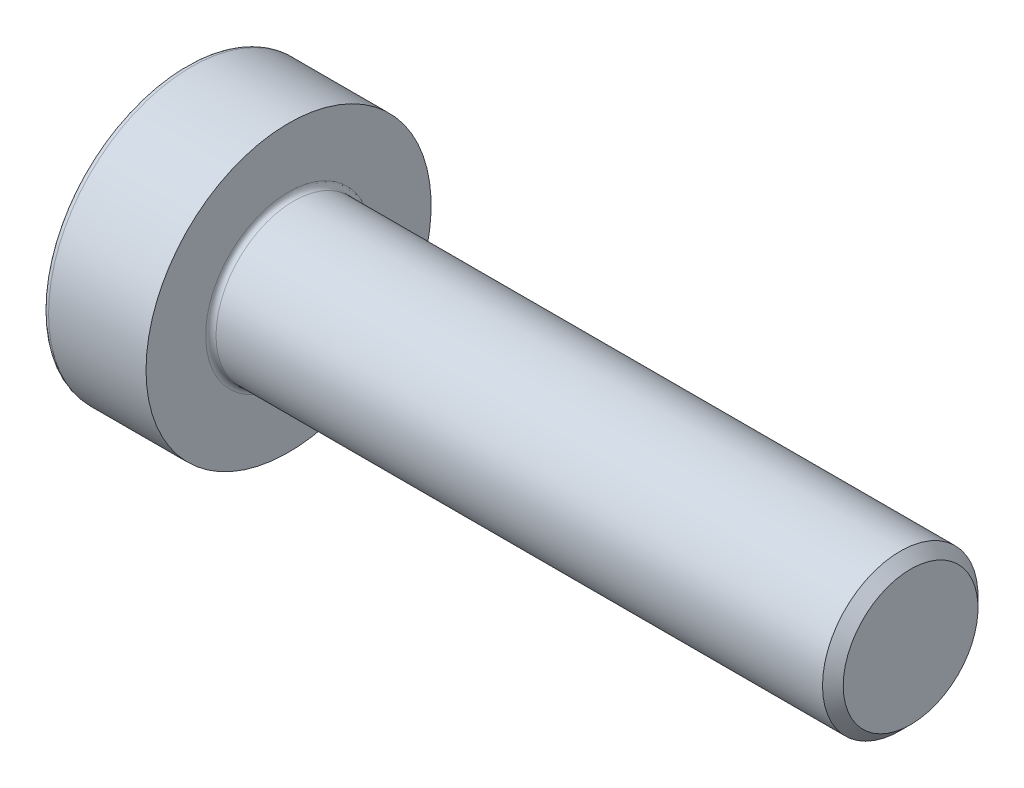
ISO-10303-21;
HEADER;
FILE_DESCRIPTION(('STEP AP214'),'2;1');
FILE_NAME('part.step','',(''),(''),'','','');
FILE_SCHEMA(('AUTOMOTIVE_DESIGN { 1 0 10303 214 1 1 1 1 }'));
ENDSEC;
DATA;
#1=APPLICATION_CONTEXT('core data for automotive mechanical design processes');
#2=APPLICATION_PROTOCOL_DEFINITION('international standard','automotive_design',2000,#1);
#3=PRODUCT_CONTEXT('',#1,'mechanical');
#4=PRODUCT('Part','Part','',(#3));
#5=PRODUCT_RELATED_PRODUCT_CATEGORY('part','',(#4));
#6=PRODUCT_DEFINITION_FORMATION('','',#4);
#7=PRODUCT_DEFINITION_CONTEXT('part definition',#1,'design');
#8=PRODUCT_DEFINITION('design','',#6,#7);
#9=PRODUCT_DEFINITION_SHAPE('','',#8);
#10=(LENGTH_UNIT() NAMED_UNIT(*) SI_UNIT(.MILLI.,.METRE.));
#11=(NAMED_UNIT(*) PLANE_ANGLE_UNIT() SI_UNIT($,.RADIAN.));
#12=(NAMED_UNIT(*) SI_UNIT($,.STERADIAN.) SOLID_ANGLE_UNIT());
#13=UNCERTAINTY_MEASURE_WITH_UNIT(LENGTH_MEASURE(1.E-05),#10,'distance_accuracy_value','');
#14=(GEOMETRIC_REPRESENTATION_CONTEXT(3) GLOBAL_UNCERTAINTY_ASSIGNED_CONTEXT((#13)) GLOBAL_UNIT_ASSIGNED_CONTEXT((#10,
#11,#12)) REPRESENTATION_CONTEXT('',''));
#15=CARTESIAN_POINT('',(0.,0.,0.));
#16=DIRECTION('',(0.,0.,1.));
#17=DIRECTION('',(1.,0.,0.));
#18=AXIS2_PLACEMENT_3D('',#15,#16,#17);
#19=CARTESIAN_POINT('',(14.,0.,0.));
#20=DIRECTION('',(-1.,0.,0.));
#21=DIRECTION('',(0.,0.,1.));
#22=AXIS2_PLACEMENT_3D('',#19,#20,#21);
#23=PLANE('',#22);
#24=CARTESIAN_POINT('',(14.,0.,0.));
#25=DIRECTION('',(-1.,0.,0.));
#26=DIRECTION('',(0.,0.,1.));
#27=AXIS2_PLACEMENT_3D('',#24,#25,#26);
#28=CIRCLE('',#27,1.3);
#29=CARTESIAN_POINT('',(14.,0.,1.3));
#30=VERTEX_POINT('',#29);
#31=EDGE_CURVE('E11',#30,#30,#28,.F.);
#32=ORIENTED_EDGE('',*,*,#31,.T.);
#33=EDGE_LOOP('',(#32));
#34=FACE_BOUND('',#33,.T.);
#35=ADVANCED_FACE('F35',(#34),#23,.F.);
#36=CARTESIAN_POINT('',(0.,0.,0.));
#37=DIRECTION('',(-1.,0.,0.));
#38=DIRECTION('',(0.,0.,1.));
#39=AXIS2_PLACEMENT_3D('',#36,#37,#38);
#40=CYLINDRICAL_SURFACE('',#39,1.5);
#41=CARTESIAN_POINT('',(13.8,0.,0.));
#42=DIRECTION('',(-1.,0.,0.));
#43=DIRECTION('',(0.,0.,1.));
#44=AXIS2_PLACEMENT_3D('',#41,#42,#43);
#45=CIRCLE('',#44,1.5);
#46=CARTESIAN_POINT('',(13.8,0.,1.5));
#47=VERTEX_POINT('',#46);
#48=EDGE_CURVE('E43',#47,#47,#45,.T.);
#49=ORIENTED_EDGE('',*,*,#48,.T.);
#50=EDGE_LOOP('',(#49));
#51=FACE_BOUND('',#50,.T.);
#52=CARTESIAN_POINT('',(2.1,0.,0.));
#53=DIRECTION('',(1.,0.,0.));
#54=DIRECTION('',(0.,0.,-1.));
#55=AXIS2_PLACEMENT_3D('',#52,#53,#54);
#56=CIRCLE('',#55,1.5);
#57=CARTESIAN_POINT('',(2.1,0.,-1.5));
#58=VERTEX_POINT('',#57);
#59=EDGE_CURVE('E148',#58,#58,#56,.T.);
#60=ORIENTED_EDGE('',*,*,#59,.T.);
#61=EDGE_LOOP('',(#60));
#62=FACE_BOUND('',#61,.T.);
#63=ADVANCED_FACE('F159',(#51,#62),#40,.T.);
#64=CARTESIAN_POINT('',(2.,0.,0.));
#65=DIRECTION('',(1.,0.,0.));
#66=DIRECTION('',(0.,0.,-1.));
#67=AXIS2_PLACEMENT_3D('',#64,#65,#66);
#68=PLANE('',#67);
#69=CARTESIAN_POINT('',(2.,0.,0.));
#70=DIRECTION('',(1.,0.,0.));
#71=DIRECTION('',(0.,0.,-1.));
#72=AXIS2_PLACEMENT_3D('',#69,#70,#71);
#73=CIRCLE('',#72,1.6);
#74=CARTESIAN_POINT('',(2.,0.,-1.6));
#75=VERTEX_POINT('',#74);
#76=EDGE_CURVE('E145',#75,#75,#73,.F.);
#77=ORIENTED_EDGE('',*,*,#76,.T.);
#78=EDGE_LOOP('',(#77));
#79=FACE_BOUND('',#78,.T.);
#80=CARTESIAN_POINT('',(2.,0.,0.));
#81=DIRECTION('',(-1.,0.,0.));
#82=DIRECTION('',(0.,0.,1.));
#83=AXIS2_PLACEMENT_3D('',#80,#81,#82);
#84=CIRCLE('',#83,2.75);
#85=CARTESIAN_POINT('',(2.,0.,2.75));
#86=VERTEX_POINT('',#85);
#87=EDGE_CURVE('E137',#86,#86,#84,.T.);
#88=ORIENTED_EDGE('',*,*,#87,.F.);
#89=EDGE_LOOP('',(#88));
#90=FACE_BOUND('',#89,.T.);
#91=ADVANCED_FACE('F181',(#79,#90),#68,.T.);
#92=CARTESIAN_POINT('',(0.,0.,0.));
#93=DIRECTION('',(-1.,0.,0.));
#94=DIRECTION('',(0.,0.,1.));
#95=AXIS2_PLACEMENT_3D('',#92,#93,#94);
#96=CYLINDRICAL_SURFACE('',#95,2.75);
#97=CARTESIAN_POINT('',(0.12,0.,0.));
#98=DIRECTION('',(-1.,0.,0.));
#99=DIRECTION('',(0.,0.,1.));
#100=AXIS2_PLACEMENT_3D('',#97,#98,#99);
#101=CIRCLE('',#100,2.75);
#102=CARTESIAN_POINT('',(0.12,0.,2.75));
#103=VERTEX_POINT('',#102);
#104=EDGE_CURVE('E154',#103,#103,#101,.F.);
#105=ORIENTED_EDGE('',*,*,#104,.T.);
#106=EDGE_LOOP('',(#105));
#107=FACE_BOUND('',#106,.T.);
#108=ORIENTED_EDGE('',*,*,#87,.T.);
#109=EDGE_LOOP('',(#108));
#110=FACE_BOUND('',#109,.T.);
#111=ADVANCED_FACE('F191',(#107,#110),#96,.T.);
#112=CARTESIAN_POINT('',(0.,0.,0.));
#113=DIRECTION('',(-1.,0.,0.));
#114=DIRECTION('',(0.,0.,1.));
#115=AXIS2_PLACEMENT_3D('',#112,#113,#114);
#116=PLANE('',#115);
#117=DIRECTION('',(0.,0.5,-0.866025403784439));
#118=VECTOR('',#117,1.);
#119=CARTESIAN_POINT('',(0.,0.721687836487033,1.25));
#120=LINE('',#119,#118);
#121=CARTESIAN_POINT('',(0.,0.721687836487033,1.25));
#122=VERTEX_POINT('',#121);
#123=CARTESIAN_POINT('',(0.,1.44337567297406,0.));
#124=VERTEX_POINT('',#123);
#125=EDGE_CURVE('E50',#122,#124,#120,.T.);
#126=ORIENTED_EDGE('',*,*,#125,.F.);
#127=DIRECTION('',(0.,1.,0.));
#128=VECTOR('',#127,1.);
#129=CARTESIAN_POINT('',(0.,-0.721687836487032,1.25));
#130=LINE('',#129,#128);
#131=CARTESIAN_POINT('',(0.,-0.721687836487032,1.25));
#132=VERTEX_POINT('',#131);
#133=EDGE_CURVE('E133',#132,#122,#130,.T.);
#134=ORIENTED_EDGE('',*,*,#133,.F.);
#135=DIRECTION('',(0.,0.5,0.866025403784439));
#136=VECTOR('',#135,1.);
#137=CARTESIAN_POINT('',(0.,-1.44337567297406,0.));
#138=LINE('',#137,#136);
#139=CARTESIAN_POINT('',(0.,-1.44337567297406,0.));
#140=VERTEX_POINT('',#139);
#141=EDGE_CURVE('E131',#140,#132,#138,.T.);
#142=ORIENTED_EDGE('',*,*,#141,.F.);
#143=DIRECTION('',(0.,-0.5,0.866025403784439));
#144=VECTOR('',#143,1.);
#145=CARTESIAN_POINT('',(0.,-0.721687836487033,-1.25));
#146=LINE('',#145,#144);
#147=CARTESIAN_POINT('',(0.,-0.721687836487033,-1.25));
#148=VERTEX_POINT('',#147);
#149=EDGE_CURVE('E98',#148,#140,#146,.T.);
#150=ORIENTED_EDGE('',*,*,#149,.F.);
#151=DIRECTION('',(0.,-1.,0.));
#152=VECTOR('',#151,1.);
#153=CARTESIAN_POINT('',(0.,0.721687836487032,-1.25));
#154=LINE('',#153,#152);
#155=CARTESIAN_POINT('',(0.,0.721687836487032,-1.25));
#156=VERTEX_POINT('',#155);
#157=EDGE_CURVE('E127',#156,#148,#154,.T.);
#158=ORIENTED_EDGE('',*,*,#157,.F.);
#159=DIRECTION('',(0.,-0.5,-0.866025403784439));
#160=VECTOR('',#159,1.);
#161=CARTESIAN_POINT('',(0.,1.44337567297406,0.));
#162=LINE('',#161,#160);
#163=EDGE_CURVE('E124',#124,#156,#162,.T.);
#164=ORIENTED_EDGE('',*,*,#163,.F.);
#165=EDGE_LOOP('',(#126,#134,#142,#150,#158,#164));
#166=FACE_BOUND('',#165,.T.);
#167=CARTESIAN_POINT('',(0.,0.,0.));
#168=DIRECTION('',(-1.,0.,0.));
#169=DIRECTION('',(0.,0.,1.));
#170=AXIS2_PLACEMENT_3D('',#167,#168,#169);
#171=CIRCLE('',#170,2.63);
#172=CARTESIAN_POINT('',(0.,0.,2.63));
#173=VERTEX_POINT('',#172);
#174=EDGE_CURVE('E151',#173,#173,#171,.T.);
#175=ORIENTED_EDGE('',*,*,#174,.T.);
#176=EDGE_LOOP('',(#175));
#177=FACE_BOUND('',#176,.T.);
#178=ADVANCED_FACE('F186',(#166,#177),#116,.T.);
#179=CARTESIAN_POINT('',(2.1,0.,0.));
#180=DIRECTION('',(1.,0.,0.));
#181=DIRECTION('',(0.,0.,-1.));
#182=AXIS2_PLACEMENT_3D('',#179,#180,#181);
#183=TOROIDAL_SURFACE('',#182,1.6,0.1);
#184=ORIENTED_EDGE('',*,*,#59,.F.);
#185=EDGE_LOOP('',(#184));
#186=FACE_BOUND('',#185,.T.);
#187=ORIENTED_EDGE('',*,*,#76,.F.);
#188=EDGE_LOOP('',(#187));
#189=FACE_BOUND('',#188,.T.);
#190=ADVANCED_FACE('F172',(#186,#189),#183,.F.);
#191=CARTESIAN_POINT('',(0.12,0.,0.));
#192=DIRECTION('',(-1.,0.,0.));
#193=DIRECTION('',(0.,0.,1.));
#194=AXIS2_PLACEMENT_3D('',#191,#192,#193);
#195=TOROIDAL_SURFACE('',#194,2.63,0.12);
#196=ORIENTED_EDGE('',*,*,#104,.F.);
#197=EDGE_LOOP('',(#196));
#198=FACE_BOUND('',#197,.T.);
#199=ORIENTED_EDGE('',*,*,#174,.F.);
#200=EDGE_LOOP('',(#199));
#201=FACE_BOUND('',#200,.T.);
#202=ADVANCED_FACE('F164',(#198,#201),#195,.T.);
#203=CARTESIAN_POINT('',(13.8,0.,0.));
#204=DIRECTION('',(-1.,0.,0.));
#205=DIRECTION('',(0.,0.,1.));
#206=AXIS2_PLACEMENT_3D('',#203,#204,#205);
#207=CONICAL_SURFACE('',#206,1.5,0.785398163397444);
#208=ORIENTED_EDGE('',*,*,#31,.F.);
#209=EDGE_LOOP('',(#208));
#210=FACE_BOUND('',#209,.T.);
#211=ORIENTED_EDGE('',*,*,#48,.F.);
#212=EDGE_LOOP('',(#211));
#213=FACE_BOUND('',#212,.T.);
#214=ADVANCED_FACE('F37',(#210,#213),#207,.T.);
#215=CARTESIAN_POINT('',(1.,0.721687836487033,1.25));
#216=DIRECTION('',(0.,0.866025403784439,0.5));
#217=DIRECTION('',(0.,-0.5,0.866025403784439));
#218=AXIS2_PLACEMENT_3D('',#215,#216,#217);
#219=PLANE('',#218);
#220=ORIENTED_EDGE('',*,*,#125,.T.);
#221=DIRECTION('',(-1.,0.,0.));
#222=VECTOR('',#221,1.);
#223=CARTESIAN_POINT('',(1.,1.44337567297406,0.));
#224=LINE('',#223,#222);
#225=CARTESIAN_POINT('',(1.,1.44337567297406,0.));
#226=VERTEX_POINT('',#225);
#227=EDGE_CURVE('E80',#226,#124,#224,.T.);
#228=ORIENTED_EDGE('',*,*,#227,.F.);
#229=DIRECTION('',(0.,0.5,-0.866025403784439));
#230=VECTOR('',#229,1.);
#231=CARTESIAN_POINT('',(1.,0.721687836487033,1.25));
#232=LINE('',#231,#230);
#233=CARTESIAN_POINT('',(1.,0.721687836487033,1.25));
#234=VERTEX_POINT('',#233);
#235=EDGE_CURVE('E135',#234,#226,#232,.T.);
#236=ORIENTED_EDGE('',*,*,#235,.F.);
#237=DIRECTION('',(-1.,0.,0.));
#238=VECTOR('',#237,1.);
#239=CARTESIAN_POINT('',(1.,0.721687836487033,1.25));
#240=LINE('',#239,#238);
#241=EDGE_CURVE('E58',#234,#122,#240,.T.);
#242=ORIENTED_EDGE('',*,*,#241,.T.);
#243=EDGE_LOOP('',(#220,#228,#236,#242));
#244=FACE_BOUND('',#243,.T.);
#245=ADVANCED_FACE('F163',(#244),#219,.F.);
#246=CARTESIAN_POINT('',(1.,-0.721687836487032,1.25));
#247=DIRECTION('',(0.,0.,1.));
#248=DIRECTION('',(0.,-1.,0.));
#249=AXIS2_PLACEMENT_3D('',#246,#247,#248);
#250=PLANE('',#249);
#251=ORIENTED_EDGE('',*,*,#133,.T.);
#252=ORIENTED_EDGE('',*,*,#241,.F.);
#253=DIRECTION('',(0.,1.,0.));
#254=VECTOR('',#253,1.);
#255=CARTESIAN_POINT('',(1.,-0.721687836487032,1.25));
#256=LINE('',#255,#254);
#257=CARTESIAN_POINT('',(1.,-0.721687836487032,1.25));
#258=VERTEX_POINT('',#257);
#259=EDGE_CURVE('E110',#258,#234,#256,.T.);
#260=ORIENTED_EDGE('',*,*,#259,.F.);
#261=DIRECTION('',(-1.,0.,0.));
#262=VECTOR('',#261,1.);
#263=CARTESIAN_POINT('',(1.,-0.721687836487032,1.25));
#264=LINE('',#263,#262);
#265=EDGE_CURVE('E102',#258,#132,#264,.T.);
#266=ORIENTED_EDGE('',*,*,#265,.T.);
#267=EDGE_LOOP('',(#251,#252,#260,#266));
#268=FACE_BOUND('',#267,.T.);
#269=ADVANCED_FACE('F170',(#268),#250,.F.);
#270=CARTESIAN_POINT('',(1.,-1.44337567297406,0.));
#271=DIRECTION('',(0.,-0.866025403784439,0.5));
#272=DIRECTION('',(0.,-0.5,-0.866025403784439));
#273=AXIS2_PLACEMENT_3D('',#270,#271,#272);
#274=PLANE('',#273);
#275=ORIENTED_EDGE('',*,*,#141,.T.);
#276=ORIENTED_EDGE('',*,*,#265,.F.);
#277=DIRECTION('',(0.,0.5,0.866025403784439));
#278=VECTOR('',#277,1.);
#279=CARTESIAN_POINT('',(1.,-1.44337567297406,0.));
#280=LINE('',#279,#278);
#281=CARTESIAN_POINT('',(1.,-1.44337567297406,0.));
#282=VERTEX_POINT('',#281);
#283=EDGE_CURVE('E106',#282,#258,#280,.T.);
#284=ORIENTED_EDGE('',*,*,#283,.F.);
#285=DIRECTION('',(-1.,0.,0.));
#286=VECTOR('',#285,1.);
#287=CARTESIAN_POINT('',(1.,-1.44337567297406,0.));
#288=LINE('',#287,#286);
#289=EDGE_CURVE('E91',#282,#140,#288,.T.);
#290=ORIENTED_EDGE('',*,*,#289,.T.);
#291=EDGE_LOOP('',(#275,#276,#284,#290));
#292=FACE_BOUND('',#291,.T.);
#293=ADVANCED_FACE('F107',(#292),#274,.F.);
#294=CARTESIAN_POINT('',(1.,-0.721687836487033,-1.25));
#295=DIRECTION('',(0.,-0.866025403784439,-0.5));
#296=DIRECTION('',(0.,0.5,-0.866025403784439));
#297=AXIS2_PLACEMENT_3D('',#294,#295,#296);
#298=PLANE('',#297);
#299=ORIENTED_EDGE('',*,*,#149,.T.);
#300=ORIENTED_EDGE('',*,*,#289,.F.);
#301=DIRECTION('',(0.,-0.5,0.866025403784439));
#302=VECTOR('',#301,1.);
#303=CARTESIAN_POINT('',(1.,-0.721687836487033,-1.25));
#304=LINE('',#303,#302);
#305=CARTESIAN_POINT('',(1.,-0.721687836487033,-1.25));
#306=VERTEX_POINT('',#305);
#307=EDGE_CURVE('E95',#306,#282,#304,.T.);
#308=ORIENTED_EDGE('',*,*,#307,.F.);
#309=DIRECTION('',(-1.,0.,0.));
#310=VECTOR('',#309,1.);
#311=CARTESIAN_POINT('',(1.,-0.721687836487033,-1.25));
#312=LINE('',#311,#310);
#313=EDGE_CURVE('E103',#306,#148,#312,.T.);
#314=ORIENTED_EDGE('',*,*,#313,.T.);
#315=EDGE_LOOP('',(#299,#300,#308,#314));
#316=FACE_BOUND('',#315,.T.);
#317=ADVANCED_FACE('F93',(#316),#298,.F.);
#318=CARTESIAN_POINT('',(1.,0.721687836487032,-1.25));
#319=DIRECTION('',(0.,0.,-1.));
#320=DIRECTION('',(0.,1.,0.));
#321=AXIS2_PLACEMENT_3D('',#318,#319,#320);
#322=PLANE('',#321);
#323=ORIENTED_EDGE('',*,*,#157,.T.);
#324=ORIENTED_EDGE('',*,*,#313,.F.);
#325=DIRECTION('',(0.,-1.,0.));
#326=VECTOR('',#325,1.);
#327=CARTESIAN_POINT('',(1.,0.721687836487032,-1.25));
#328=LINE('',#327,#326);
#329=CARTESIAN_POINT('',(1.,0.721687836487032,-1.25));
#330=VERTEX_POINT('',#329);
#331=EDGE_CURVE('E116',#330,#306,#328,.T.);
#332=ORIENTED_EDGE('',*,*,#331,.F.);
#333=DIRECTION('',(-1.,0.,0.));
#334=VECTOR('',#333,1.);
#335=CARTESIAN_POINT('',(1.,0.721687836487032,-1.25));
#336=LINE('',#335,#334);
#337=EDGE_CURVE('E140',#330,#156,#336,.T.);
#338=ORIENTED_EDGE('',*,*,#337,.T.);
#339=EDGE_LOOP('',(#323,#324,#332,#338));
#340=FACE_BOUND('',#339,.T.);
#341=ADVANCED_FACE('F211',(#340),#322,.F.);
#342=CARTESIAN_POINT('',(1.,1.44337567297406,0.));
#343=DIRECTION('',(0.,0.866025403784439,-0.5));
#344=DIRECTION('',(0.,0.5,0.866025403784439));
#345=AXIS2_PLACEMENT_3D('',#342,#343,#344);
#346=PLANE('',#345);
#347=ORIENTED_EDGE('',*,*,#163,.T.);
#348=ORIENTED_EDGE('',*,*,#337,.F.);
#349=DIRECTION('',(0.,-0.5,-0.866025403784439));
#350=VECTOR('',#349,1.);
#351=CARTESIAN_POINT('',(1.,1.44337567297406,0.));
#352=LINE('',#351,#350);
#353=EDGE_CURVE('E118',#226,#330,#352,.T.);
#354=ORIENTED_EDGE('',*,*,#353,.F.);
#355=ORIENTED_EDGE('',*,*,#227,.T.);
#356=EDGE_LOOP('',(#347,#348,#354,#355));
#357=FACE_BOUND('',#356,.T.);
#358=ADVANCED_FACE('F208',(#357),#346,.F.);
#359=CARTESIAN_POINT('',(1.,0.,0.));
#360=DIRECTION('',(-1.,0.,0.));
#361=DIRECTION('',(0.,0.,1.));
#362=AXIS2_PLACEMENT_3D('',#359,#360,#361);
#363=PLANE('',#362);
#364=ORIENTED_EDGE('',*,*,#235,.T.);
#365=ORIENTED_EDGE('',*,*,#353,.T.);
#366=ORIENTED_EDGE('',*,*,#331,.T.);
#367=ORIENTED_EDGE('',*,*,#307,.T.);
#368=ORIENTED_EDGE('',*,*,#283,.T.);
#369=ORIENTED_EDGE('',*,*,#259,.T.);
#370=EDGE_LOOP('',(#364,#365,#366,#367,#368,#369));
#371=FACE_BOUND('',#370,.T.);
#372=ADVANCED_FACE('F113',(#371),#363,.T.);
#373=CLOSED_SHELL('',(#35,#63,#91,#111,#178,#190,#202,#214,#245,#269,#293,#317,#341,#358,#372));
#374=MANIFOLD_SOLID_BREP('B2',#373);
#375=ADVANCED_BREP_SHAPE_REPRESENTATION('',(#18,#374),#14);
#376=SHAPE_DEFINITION_REPRESENTATION(#9,#375);
ENDSEC;
END-ISO-10303-21;
